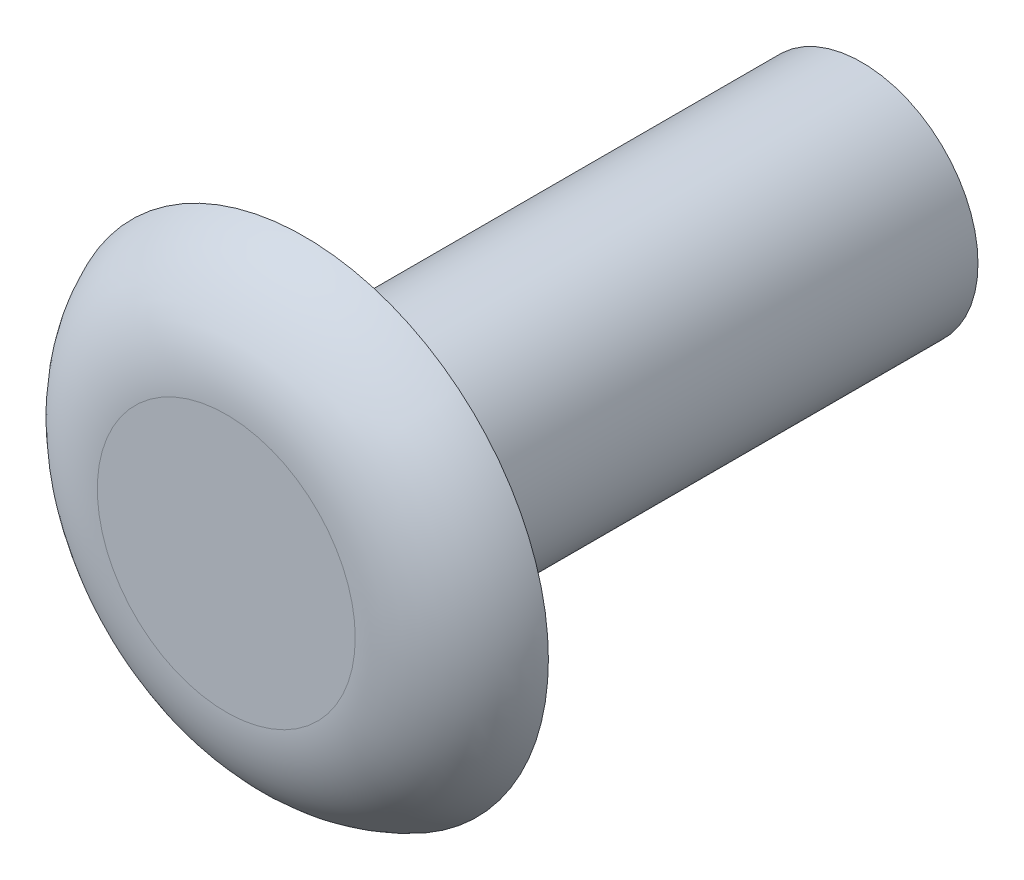
ISO-10303-21;
HEADER;
FILE_DESCRIPTION(('STEP AP214'),'2;1');
FILE_NAME('part.step','',(''),(''),'','','');
FILE_SCHEMA(('AUTOMOTIVE_DESIGN { 1 0 10303 214 1 1 1 1 }'));
ENDSEC;
DATA;
#1=APPLICATION_CONTEXT('core data for automotive mechanical design processes');
#2=APPLICATION_PROTOCOL_DEFINITION('international standard','automotive_design',2000,#1);
#3=PRODUCT_CONTEXT('',#1,'mechanical');
#4=PRODUCT('Part','Part','',(#3));
#5=PRODUCT_RELATED_PRODUCT_CATEGORY('part','',(#4));
#6=PRODUCT_DEFINITION_FORMATION('','',#4);
#7=PRODUCT_DEFINITION_CONTEXT('part definition',#1,'design');
#8=PRODUCT_DEFINITION('design','',#6,#7);
#9=PRODUCT_DEFINITION_SHAPE('','',#8);
#10=(LENGTH_UNIT() NAMED_UNIT(*) SI_UNIT(.MILLI.,.METRE.));
#11=(NAMED_UNIT(*) PLANE_ANGLE_UNIT() SI_UNIT($,.RADIAN.));
#12=(NAMED_UNIT(*) SI_UNIT($,.STERADIAN.) SOLID_ANGLE_UNIT());
#13=UNCERTAINTY_MEASURE_WITH_UNIT(LENGTH_MEASURE(1.E-05),#10,'distance_accuracy_value','');
#14=(GEOMETRIC_REPRESENTATION_CONTEXT(3) GLOBAL_UNCERTAINTY_ASSIGNED_CONTEXT((#13)) GLOBAL_UNIT_ASSIGNED_CONTEXT((#10,
#11,#12)) REPRESENTATION_CONTEXT('',''));
#15=CARTESIAN_POINT('',(0.,0.,0.));
#16=DIRECTION('',(0.,0.,1.));
#17=DIRECTION('',(1.,0.,0.));
#18=AXIS2_PLACEMENT_3D('',#15,#16,#17);
#19=CARTESIAN_POINT('',(0.,0.,1.6002));
#20=DIRECTION('',(0.,0.,1.));
#21=DIRECTION('',(1.,0.,0.));
#22=AXIS2_PLACEMENT_3D('',#19,#20,#21);
#23=PLANE('',#22);
#24=CARTESIAN_POINT('',(0.,0.,1.6002));
#25=DIRECTION('',(0.,0.,1.));
#26=DIRECTION('',(1.,0.,0.));
#27=AXIS2_PLACEMENT_3D('',#24,#25,#26);
#28=CIRCLE('',#27,2.64405934475841);
#29=CARTESIAN_POINT('',(2.64405934475841,0.,1.6002));
#30=VERTEX_POINT('',#29);
#31=EDGE_CURVE('E10',#30,#30,#28,.T.);
#32=ORIENTED_EDGE('',*,*,#31,.T.);
#33=EDGE_LOOP('',(#32));
#34=FACE_BOUND('',#33,.T.);
#35=ADVANCED_FACE('F37',(#34),#23,.T.);
#36=CARTESIAN_POINT('',(0.,0.,0.));
#37=DIRECTION('',(0.,0.,1.));
#38=DIRECTION('',(1.,0.,0.));
#39=AXIS2_PLACEMENT_3D('',#36,#37,#38);
#40=PLANE('',#39);
#41=CARTESIAN_POINT('',(0.,0.,0.));
#42=DIRECTION('',(0.,0.,1.));
#43=DIRECTION('',(1.,0.,0.));
#44=AXIS2_PLACEMENT_3D('',#41,#42,#43);
#45=CIRCLE('',#44,2.38125);
#46=CARTESIAN_POINT('',(2.38125,0.,0.));
#47=VERTEX_POINT('',#46);
#48=EDGE_CURVE('E52',#47,#47,#45,.T.);
#49=ORIENTED_EDGE('',*,*,#48,.T.);
#50=EDGE_LOOP('',(#49));
#51=FACE_BOUND('',#50,.T.);
#52=CARTESIAN_POINT('',(0.,0.,0.));
#53=DIRECTION('',(0.,0.,1.));
#54=DIRECTION('',(1.,0.,0.));
#55=AXIS2_PLACEMENT_3D('',#52,#53,#54);
#56=CIRCLE('',#55,5.0038);
#57=CARTESIAN_POINT('',(5.0038,0.,0.));
#58=VERTEX_POINT('',#57);
#59=EDGE_CURVE('E44',#58,#58,#56,.T.);
#60=ORIENTED_EDGE('',*,*,#59,.F.);
#61=EDGE_LOOP('',(#60));
#62=FACE_BOUND('',#61,.T.);
#63=ADVANCED_FACE('F58',(#51,#62),#40,.F.);
#64=CARTESIAN_POINT('',(0.,0.,-11.43));
#65=DIRECTION('',(0.,0.,1.));
#66=DIRECTION('',(1.,0.,0.));
#67=AXIS2_PLACEMENT_3D('',#64,#65,#66);
#68=CYLINDRICAL_SURFACE('',#67,2.38125);
#69=CARTESIAN_POINT('',(0.,0.,-11.43));
#70=DIRECTION('',(0.,0.,1.));
#71=DIRECTION('',(1.,0.,0.));
#72=AXIS2_PLACEMENT_3D('',#69,#70,#71);
#73=CIRCLE('',#72,2.38125);
#74=CARTESIAN_POINT('',(2.38125,0.,-11.43));
#75=VERTEX_POINT('',#74);
#76=EDGE_CURVE('E48',#75,#75,#73,.T.);
#77=ORIENTED_EDGE('',*,*,#76,.T.);
#78=EDGE_LOOP('',(#77));
#79=FACE_BOUND('',#78,.T.);
#80=ORIENTED_EDGE('',*,*,#48,.F.);
#81=EDGE_LOOP('',(#80));
#82=FACE_BOUND('',#81,.T.);
#83=ADVANCED_FACE('F61',(#79,#82),#68,.T.);
#84=CARTESIAN_POINT('',(0.,0.,-11.43));
#85=DIRECTION('',(0.,0.,1.));
#86=DIRECTION('',(1.,0.,0.));
#87=AXIS2_PLACEMENT_3D('',#84,#85,#86);
#88=PLANE('',#87);
#89=ORIENTED_EDGE('',*,*,#76,.F.);
#90=EDGE_LOOP('',(#89));
#91=FACE_BOUND('',#90,.T.);
#92=ADVANCED_FACE('F63',(#91),#88,.F.);
#93=CARTESIAN_POINT('',(0.,0.,-0.9398));
#94=DIRECTION('',(0.,0.,-1.));
#95=DIRECTION('',(-1.,0.,0.));
#96=AXIS2_PLACEMENT_3D('',#93,#94,#95);
#97=TOROIDAL_SURFACE('',#96,2.64405934475841,2.54);
#98=ORIENTED_EDGE('',*,*,#59,.T.);
#99=EDGE_LOOP('',(#98));
#100=FACE_BOUND('',#99,.T.);
#101=ORIENTED_EDGE('',*,*,#31,.F.);
#102=EDGE_LOOP('',(#101));
#103=FACE_BOUND('',#102,.T.);
#104=ADVANCED_FACE('F39',(#100,#103),#97,.T.);
#105=CLOSED_SHELL('',(#35,#63,#83,#92,#104));
#106=MANIFOLD_SOLID_BREP('B2',#105);
#107=ADVANCED_BREP_SHAPE_REPRESENTATION('',(#18,#106),#14);
#108=SHAPE_DEFINITION_REPRESENTATION(#9,#107);
ENDSEC;
END-ISO-10303-21;
